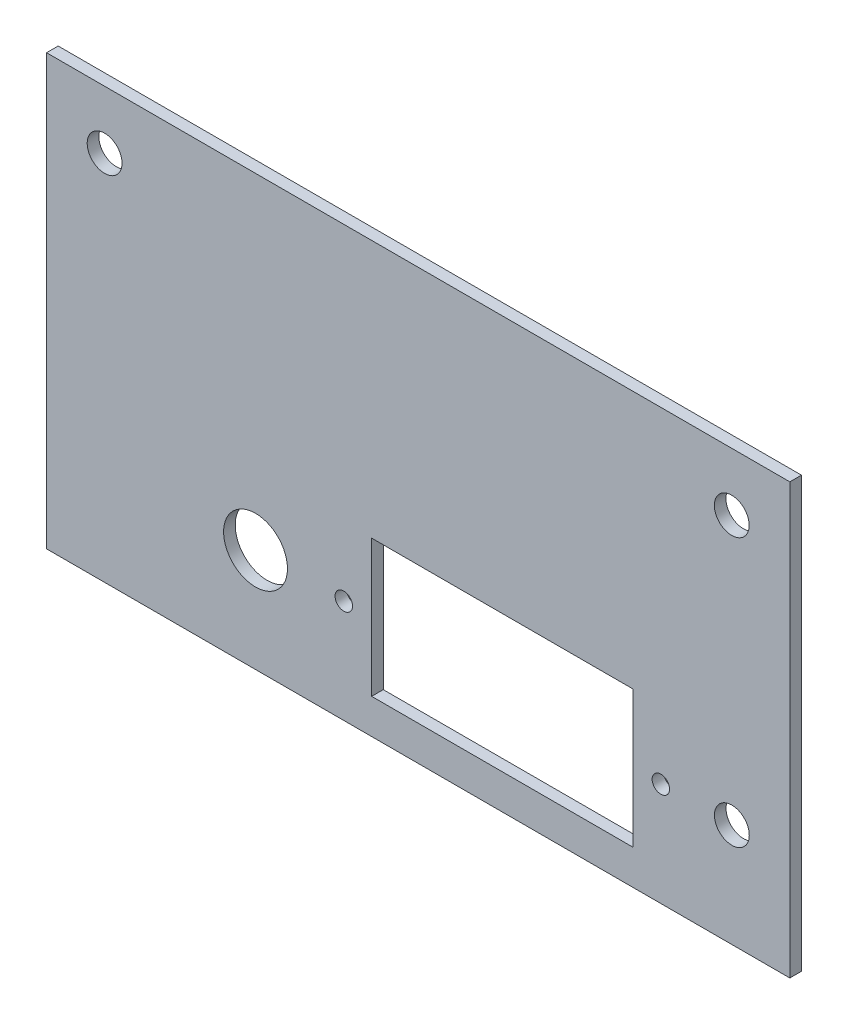
ISO-10303-21;
HEADER;
FILE_DESCRIPTION(('STEP AP214'),'2;1');
FILE_NAME('part.step','',(''),(''),'','','');
FILE_SCHEMA(('AUTOMOTIVE_DESIGN { 1 0 10303 214 1 1 1 1 }'));
ENDSEC;
DATA;
#1=APPLICATION_CONTEXT('core data for automotive mechanical design processes');
#2=APPLICATION_PROTOCOL_DEFINITION('international standard','automotive_design',2000,#1);
#3=PRODUCT_CONTEXT('',#1,'mechanical');
#4=PRODUCT('Part','Part','',(#3));
#5=PRODUCT_RELATED_PRODUCT_CATEGORY('part','',(#4));
#6=PRODUCT_DEFINITION_FORMATION('','',#4);
#7=PRODUCT_DEFINITION_CONTEXT('part definition',#1,'design');
#8=PRODUCT_DEFINITION('design','',#6,#7);
#9=PRODUCT_DEFINITION_SHAPE('','',#8);
#10=(LENGTH_UNIT() NAMED_UNIT(*) SI_UNIT(.MILLI.,.METRE.));
#11=(NAMED_UNIT(*) PLANE_ANGLE_UNIT() SI_UNIT($,.RADIAN.));
#12=(NAMED_UNIT(*) SI_UNIT($,.STERADIAN.) SOLID_ANGLE_UNIT());
#13=UNCERTAINTY_MEASURE_WITH_UNIT(LENGTH_MEASURE(1.E-05),#10,'distance_accuracy_value','');
#14=(GEOMETRIC_REPRESENTATION_CONTEXT(3) GLOBAL_UNCERTAINTY_ASSIGNED_CONTEXT((#13)) GLOBAL_UNIT_ASSIGNED_CONTEXT((#10,
#11,#12)) REPRESENTATION_CONTEXT('',''));
#15=CARTESIAN_POINT('',(0.,0.,0.));
#16=DIRECTION('',(0.,0.,1.));
#17=DIRECTION('',(1.,0.,0.));
#18=AXIS2_PLACEMENT_3D('',#15,#16,#17);
#19=CARTESIAN_POINT('',(0.,0.,1.));
#20=DIRECTION('',(0.,0.,1.));
#21=DIRECTION('',(1.,0.,0.));
#22=AXIS2_PLACEMENT_3D('',#19,#20,#21);
#23=PLANE('',#22);
#24=CARTESIAN_POINT('',(-5.32391187167302,-2.59514563290433,1.));
#25=DIRECTION('',(0.,0.,1.));
#26=DIRECTION('',(1.,0.,0.));
#27=AXIS2_PLACEMENT_3D('',#24,#25,#26);
#28=CIRCLE('',#27,2.7500000005369);
#29=CARTESIAN_POINT('',(-2.57391187113612,-2.59514563290433,1.));
#30=VERTEX_POINT('',#29);
#31=EDGE_CURVE('E265',#30,#30,#28,.T.);
#32=ORIENTED_EDGE('',*,*,#31,.F.);
#33=EDGE_LOOP('',(#32));
#34=FACE_BOUND('',#33,.T.);
#35=CARTESIAN_POINT('',(29.576088128327,-2.59514563290433,1.));
#36=DIRECTION('',(0.,0.,1.));
#37=DIRECTION('',(1.,0.,0.));
#38=AXIS2_PLACEMENT_3D('',#35,#36,#37);
#39=CIRCLE('',#38,0.750000000000002);
#40=CARTESIAN_POINT('',(30.326088128327,-2.59514563290433,1.));
#41=VERTEX_POINT('',#40);
#42=EDGE_CURVE('E277',#41,#41,#39,.T.);
#43=ORIENTED_EDGE('',*,*,#42,.F.);
#44=EDGE_LOOP('',(#43));
#45=FACE_BOUND('',#44,.T.);
#46=DIRECTION('',(1.,0.,0.));
#47=VECTOR('',#46,1.);
#48=CARTESIAN_POINT('',(4.67608812832698,-8.49514563290433,1.));
#49=LINE('',#48,#47);
#50=CARTESIAN_POINT('',(4.67608812832698,-8.49514563290433,1.));
#51=VERTEX_POINT('',#50);
#52=CARTESIAN_POINT('',(27.176088128327,-8.49514563290433,1.));
#53=VERTEX_POINT('',#52);
#54=EDGE_CURVE('E107',#51,#53,#49,.T.);
#55=ORIENTED_EDGE('',*,*,#54,.F.);
#56=DIRECTION('',(0.,-1.,0.));
#57=VECTOR('',#56,1.);
#58=CARTESIAN_POINT('',(4.67608812832698,3.30485436709567,1.));
#59=LINE('',#58,#57);
#60=CARTESIAN_POINT('',(4.67608812832698,3.30485436709567,1.));
#61=VERTEX_POINT('',#60);
#62=EDGE_CURVE('E99',#61,#51,#59,.T.);
#63=ORIENTED_EDGE('',*,*,#62,.F.);
#64=DIRECTION('',(-1.,0.,0.));
#65=VECTOR('',#64,1.);
#66=CARTESIAN_POINT('',(4.67608812832698,3.30485436709567,1.));
#67=LINE('',#66,#65);
#68=CARTESIAN_POINT('',(27.176088128327,3.30485436709567,1.));
#69=VERTEX_POINT('',#68);
#70=EDGE_CURVE('E122',#69,#61,#67,.T.);
#71=ORIENTED_EDGE('',*,*,#70,.F.);
#72=DIRECTION('',(0.,1.,0.));
#73=VECTOR('',#72,1.);
#74=CARTESIAN_POINT('',(27.176088128327,3.30485436709567,1.));
#75=LINE('',#74,#73);
#76=EDGE_CURVE('E120',#53,#69,#75,.T.);
#77=ORIENTED_EDGE('',*,*,#76,.F.);
#78=EDGE_LOOP('',(#55,#63,#71,#77));
#79=FACE_BOUND('',#78,.T.);
#80=CARTESIAN_POINT('',(-18.317093511673,20.5048543670957,1.));
#81=DIRECTION('',(0.,0.,1.));
#82=DIRECTION('',(1.,0.,0.));
#83=AXIS2_PLACEMENT_3D('',#80,#81,#82);
#84=CIRCLE('',#83,1.5);
#85=CARTESIAN_POINT('',(-16.817093511673,20.5048543670957,1.));
#86=VERTEX_POINT('',#85);
#87=EDGE_CURVE('E138',#86,#86,#84,.T.);
#88=ORIENTED_EDGE('',*,*,#87,.F.);
#89=EDGE_LOOP('',(#88));
#90=FACE_BOUND('',#89,.T.);
#91=DIRECTION('',(0.,-1.,0.));
#92=VECTOR('',#91,1.);
#93=CARTESIAN_POINT('',(-23.317093511673,25.5048543670957,1.));
#94=LINE('',#93,#92);
#95=CARTESIAN_POINT('',(-23.317093511673,25.5048543670957,1.));
#96=VERTEX_POINT('',#95);
#97=CARTESIAN_POINT('',(-23.317093511673,-11.4951456329043,1.));
#98=VERTEX_POINT('',#97);
#99=EDGE_CURVE('E144',#96,#98,#94,.T.);
#100=ORIENTED_EDGE('',*,*,#99,.T.);
#101=DIRECTION('',(1.,0.,0.));
#102=VECTOR('',#101,1.);
#103=CARTESIAN_POINT('',(-23.317093511673,-11.4951456329043,1.));
#104=LINE('',#103,#102);
#105=CARTESIAN_POINT('',(40.682906488327,-11.4951456329043,1.));
#106=VERTEX_POINT('',#105);
#107=EDGE_CURVE('E147',#98,#106,#104,.T.);
#108=ORIENTED_EDGE('',*,*,#107,.T.);
#109=DIRECTION('',(0.,1.,0.));
#110=VECTOR('',#109,1.);
#111=CARTESIAN_POINT('',(40.682906488327,25.5048543670957,1.));
#112=LINE('',#111,#110);
#113=CARTESIAN_POINT('',(40.682906488327,25.5048543670957,1.));
#114=VERTEX_POINT('',#113);
#115=EDGE_CURVE('E150',#106,#114,#112,.T.);
#116=ORIENTED_EDGE('',*,*,#115,.T.);
#117=DIRECTION('',(-1.,0.,0.));
#118=VECTOR('',#117,1.);
#119=CARTESIAN_POINT('',(-23.317093511673,25.5048543670957,1.));
#120=LINE('',#119,#118);
#121=EDGE_CURVE('E152',#114,#96,#120,.T.);
#122=ORIENTED_EDGE('',*,*,#121,.T.);
#123=EDGE_LOOP('',(#100,#108,#116,#122));
#124=FACE_BOUND('',#123,.T.);
#125=CARTESIAN_POINT('',(35.682906488327,20.5048543670957,1.));
#126=DIRECTION('',(0.,0.,1.));
#127=DIRECTION('',(1.,0.,0.));
#128=AXIS2_PLACEMENT_3D('',#125,#126,#127);
#129=CIRCLE('',#128,1.5);
#130=CARTESIAN_POINT('',(37.182906488327,20.5048543670957,1.));
#131=VERTEX_POINT('',#130);
#132=EDGE_CURVE('E128',#131,#131,#129,.T.);
#133=ORIENTED_EDGE('',*,*,#132,.F.);
#134=EDGE_LOOP('',(#133));
#135=FACE_BOUND('',#134,.T.);
#136=CARTESIAN_POINT('',(2.27608812832698,-2.59514563290433,1.));
#137=DIRECTION('',(0.,0.,1.));
#138=DIRECTION('',(1.,0.,0.));
#139=AXIS2_PLACEMENT_3D('',#136,#137,#138);
#140=CIRCLE('',#139,0.75);
#141=CARTESIAN_POINT('',(3.02608812832698,-2.59514563290433,1.));
#142=VERTEX_POINT('',#141);
#143=EDGE_CURVE('E271',#142,#142,#140,.T.);
#144=ORIENTED_EDGE('',*,*,#143,.F.);
#145=EDGE_LOOP('',(#144));
#146=FACE_BOUND('',#145,.T.);
#147=CARTESIAN_POINT('',(35.690737833595,-2.59514563290433,1.));
#148=DIRECTION('',(0.,0.,1.));
#149=DIRECTION('',(1.,0.,0.));
#150=AXIS2_PLACEMENT_3D('',#147,#148,#149);
#151=CIRCLE('',#150,1.50000000053691);
#152=CARTESIAN_POINT('',(37.1907378341319,-2.59514563290433,1.));
#153=VERTEX_POINT('',#152);
#154=EDGE_CURVE('E256',#153,#153,#151,.T.);
#155=ORIENTED_EDGE('',*,*,#154,.F.);
#156=EDGE_LOOP('',(#155));
#157=FACE_BOUND('',#156,.T.);
#158=ADVANCED_FACE('F34',(#34,#45,#79,#90,#124,#135,#146,#157),#23,.T.);
#159=CARTESIAN_POINT('',(0.,0.,0.));
#160=DIRECTION('',(0.,0.,1.));
#161=DIRECTION('',(1.,0.,0.));
#162=AXIS2_PLACEMENT_3D('',#159,#160,#161);
#163=PLANE('',#162);
#164=CARTESIAN_POINT('',(-18.317093511673,20.5048543670957,0.));
#165=DIRECTION('',(0.,0.,1.));
#166=DIRECTION('',(1.,0.,0.));
#167=AXIS2_PLACEMENT_3D('',#164,#165,#166);
#168=CIRCLE('',#167,1.5);
#169=CARTESIAN_POINT('',(-16.817093511673,20.5048543670957,0.));
#170=VERTEX_POINT('',#169);
#171=EDGE_CURVE('E115',#170,#170,#168,.T.);
#172=ORIENTED_EDGE('',*,*,#171,.T.);
#173=EDGE_LOOP('',(#172));
#174=FACE_BOUND('',#173,.T.);
#175=DIRECTION('',(0.,-1.,0.));
#176=VECTOR('',#175,1.);
#177=CARTESIAN_POINT('',(-23.317093511673,25.5048543670957,0.));
#178=LINE('',#177,#176);
#179=CARTESIAN_POINT('',(-23.317093511673,25.5048543670957,0.));
#180=VERTEX_POINT('',#179);
#181=CARTESIAN_POINT('',(-23.317093511673,-11.4951456329043,0.));
#182=VERTEX_POINT('',#181);
#183=EDGE_CURVE('E141',#180,#182,#178,.T.);
#184=ORIENTED_EDGE('',*,*,#183,.F.);
#185=DIRECTION('',(-1.,0.,0.));
#186=VECTOR('',#185,1.);
#187=CARTESIAN_POINT('',(-23.317093511673,25.5048543670957,0.));
#188=LINE('',#187,#186);
#189=CARTESIAN_POINT('',(40.682906488327,25.5048543670957,0.));
#190=VERTEX_POINT('',#189);
#191=EDGE_CURVE('E148',#190,#180,#188,.T.);
#192=ORIENTED_EDGE('',*,*,#191,.F.);
#193=DIRECTION('',(0.,1.,0.));
#194=VECTOR('',#193,1.);
#195=CARTESIAN_POINT('',(40.682906488327,25.5048543670957,0.));
#196=LINE('',#195,#194);
#197=CARTESIAN_POINT('',(40.682906488327,-11.4951456329043,0.));
#198=VERTEX_POINT('',#197);
#199=EDGE_CURVE('E159',#198,#190,#196,.T.);
#200=ORIENTED_EDGE('',*,*,#199,.F.);
#201=DIRECTION('',(1.,0.,0.));
#202=VECTOR('',#201,1.);
#203=CARTESIAN_POINT('',(-23.317093511673,-11.4951456329043,0.));
#204=LINE('',#203,#202);
#205=EDGE_CURVE('E157',#182,#198,#204,.T.);
#206=ORIENTED_EDGE('',*,*,#205,.F.);
#207=EDGE_LOOP('',(#184,#192,#200,#206));
#208=FACE_BOUND('',#207,.T.);
#209=DIRECTION('',(0.,-1.,0.));
#210=VECTOR('',#209,1.);
#211=CARTESIAN_POINT('',(4.67608812832698,3.30485436709567,0.));
#212=LINE('',#211,#210);
#213=CARTESIAN_POINT('',(4.67608812832698,3.30485436709567,0.));
#214=VERTEX_POINT('',#213);
#215=CARTESIAN_POINT('',(4.67608812832698,-8.49514563290433,0.));
#216=VERTEX_POINT('',#215);
#217=EDGE_CURVE('E57',#214,#216,#212,.T.);
#218=ORIENTED_EDGE('',*,*,#217,.T.);
#219=DIRECTION('',(1.,0.,0.));
#220=VECTOR('',#219,1.);
#221=CARTESIAN_POINT('',(4.67608812832698,-8.49514563290433,0.));
#222=LINE('',#221,#220);
#223=CARTESIAN_POINT('',(27.176088128327,-8.49514563290433,0.));
#224=VERTEX_POINT('',#223);
#225=EDGE_CURVE('E114',#216,#224,#222,.T.);
#226=ORIENTED_EDGE('',*,*,#225,.T.);
#227=DIRECTION('',(0.,1.,0.));
#228=VECTOR('',#227,1.);
#229=CARTESIAN_POINT('',(27.176088128327,3.30485436709567,0.));
#230=LINE('',#229,#228);
#231=CARTESIAN_POINT('',(27.176088128327,3.30485436709567,0.));
#232=VERTEX_POINT('',#231);
#233=EDGE_CURVE('E130',#224,#232,#230,.T.);
#234=ORIENTED_EDGE('',*,*,#233,.T.);
#235=DIRECTION('',(-1.,0.,0.));
#236=VECTOR('',#235,1.);
#237=CARTESIAN_POINT('',(4.67608812832698,3.30485436709567,0.));
#238=LINE('',#237,#236);
#239=EDGE_CURVE('E108',#232,#214,#238,.T.);
#240=ORIENTED_EDGE('',*,*,#239,.T.);
#241=EDGE_LOOP('',(#218,#226,#234,#240));
#242=FACE_BOUND('',#241,.T.);
#243=CARTESIAN_POINT('',(35.682906488327,20.5048543670957,0.));
#244=DIRECTION('',(0.,0.,1.));
#245=DIRECTION('',(1.,0.,0.));
#246=AXIS2_PLACEMENT_3D('',#243,#244,#245);
#247=CIRCLE('',#246,1.5);
#248=CARTESIAN_POINT('',(37.182906488327,20.5048543670957,0.));
#249=VERTEX_POINT('',#248);
#250=EDGE_CURVE('E280',#249,#249,#247,.T.);
#251=ORIENTED_EDGE('',*,*,#250,.T.);
#252=EDGE_LOOP('',(#251));
#253=FACE_BOUND('',#252,.T.);
#254=CARTESIAN_POINT('',(29.576088128327,-2.59514563290433,0.));
#255=DIRECTION('',(0.,0.,1.));
#256=DIRECTION('',(1.,0.,0.));
#257=AXIS2_PLACEMENT_3D('',#254,#255,#256);
#258=CIRCLE('',#257,0.750000000000002);
#259=CARTESIAN_POINT('',(30.326088128327,-2.59514563290433,0.));
#260=VERTEX_POINT('',#259);
#261=EDGE_CURVE('E274',#260,#260,#258,.T.);
#262=ORIENTED_EDGE('',*,*,#261,.T.);
#263=EDGE_LOOP('',(#262));
#264=FACE_BOUND('',#263,.T.);
#265=CARTESIAN_POINT('',(2.27608812832698,-2.59514563290433,0.));
#266=DIRECTION('',(0.,0.,1.));
#267=DIRECTION('',(1.,0.,0.));
#268=AXIS2_PLACEMENT_3D('',#265,#266,#267);
#269=CIRCLE('',#268,0.75);
#270=CARTESIAN_POINT('',(3.02608812832698,-2.59514563290433,0.));
#271=VERTEX_POINT('',#270);
#272=EDGE_CURVE('E268',#271,#271,#269,.T.);
#273=ORIENTED_EDGE('',*,*,#272,.T.);
#274=EDGE_LOOP('',(#273));
#275=FACE_BOUND('',#274,.T.);
#276=CARTESIAN_POINT('',(-5.32391187167302,-2.59514563290433,0.));
#277=DIRECTION('',(0.,0.,1.));
#278=DIRECTION('',(1.,0.,0.));
#279=AXIS2_PLACEMENT_3D('',#276,#277,#278);
#280=CIRCLE('',#279,2.7500000005369);
#281=CARTESIAN_POINT('',(-2.57391187113612,-2.59514563290433,0.));
#282=VERTEX_POINT('',#281);
#283=EDGE_CURVE('E262',#282,#282,#280,.T.);
#284=ORIENTED_EDGE('',*,*,#283,.T.);
#285=EDGE_LOOP('',(#284));
#286=FACE_BOUND('',#285,.T.);
#287=CARTESIAN_POINT('',(35.690737833595,-2.59514563290433,0.));
#288=DIRECTION('',(0.,0.,1.));
#289=DIRECTION('',(1.,0.,0.));
#290=AXIS2_PLACEMENT_3D('',#287,#288,#289);
#291=CIRCLE('',#290,1.50000000053691);
#292=CARTESIAN_POINT('',(37.1907378341319,-2.59514563290433,0.));
#293=VERTEX_POINT('',#292);
#294=EDGE_CURVE('E259',#293,#293,#291,.T.);
#295=ORIENTED_EDGE('',*,*,#294,.T.);
#296=EDGE_LOOP('',(#295));
#297=FACE_BOUND('',#296,.T.);
#298=ADVANCED_FACE('F177',(#174,#208,#242,#253,#264,#275,#286,#297),#163,.F.);
#299=CARTESIAN_POINT('',(-23.317093511673,25.5048543670957,1.));
#300=DIRECTION('',(1.,0.,0.));
#301=DIRECTION('',(0.,1.,0.));
#302=AXIS2_PLACEMENT_3D('',#299,#300,#301);
#303=PLANE('',#302);
#304=ORIENTED_EDGE('',*,*,#183,.T.);
#305=DIRECTION('',(0.,0.,-1.));
#306=VECTOR('',#305,1.);
#307=CARTESIAN_POINT('',(-23.317093511673,-11.4951456329043,1.));
#308=LINE('',#307,#306);
#309=EDGE_CURVE('E11',#98,#182,#308,.T.);
#310=ORIENTED_EDGE('',*,*,#309,.F.);
#311=ORIENTED_EDGE('',*,*,#99,.F.);
#312=DIRECTION('',(0.,0.,-1.));
#313=VECTOR('',#312,1.);
#314=CARTESIAN_POINT('',(-23.317093511673,25.5048543670957,1.));
#315=LINE('',#314,#313);
#316=EDGE_CURVE('E154',#96,#180,#315,.T.);
#317=ORIENTED_EDGE('',*,*,#316,.T.);
#318=EDGE_LOOP('',(#304,#310,#311,#317));
#319=FACE_BOUND('',#318,.T.);
#320=ADVANCED_FACE('F36',(#319),#303,.F.);
#321=CARTESIAN_POINT('',(-23.317093511673,-11.4951456329043,1.));
#322=DIRECTION('',(0.,1.,0.));
#323=DIRECTION('',(-1.,0.,0.));
#324=AXIS2_PLACEMENT_3D('',#321,#322,#323);
#325=PLANE('',#324);
#326=ORIENTED_EDGE('',*,*,#205,.T.);
#327=DIRECTION('',(0.,0.,-1.));
#328=VECTOR('',#327,1.);
#329=CARTESIAN_POINT('',(40.682906488327,-11.4951456329043,1.));
#330=LINE('',#329,#328);
#331=EDGE_CURVE('E42',#106,#198,#330,.T.);
#332=ORIENTED_EDGE('',*,*,#331,.F.);
#333=ORIENTED_EDGE('',*,*,#107,.F.);
#334=ORIENTED_EDGE('',*,*,#309,.T.);
#335=EDGE_LOOP('',(#326,#332,#333,#334));
#336=FACE_BOUND('',#335,.T.);
#337=ADVANCED_FACE('F188',(#336),#325,.F.);
#338=CARTESIAN_POINT('',(40.682906488327,25.5048543670957,1.));
#339=DIRECTION('',(-1.,0.,0.));
#340=DIRECTION('',(0.,-1.,0.));
#341=AXIS2_PLACEMENT_3D('',#338,#339,#340);
#342=PLANE('',#341);
#343=ORIENTED_EDGE('',*,*,#199,.T.);
#344=DIRECTION('',(0.,0.,-1.));
#345=VECTOR('',#344,1.);
#346=CARTESIAN_POINT('',(40.682906488327,25.5048543670957,1.));
#347=LINE('',#346,#345);
#348=EDGE_CURVE('E164',#114,#190,#347,.T.);
#349=ORIENTED_EDGE('',*,*,#348,.F.);
#350=ORIENTED_EDGE('',*,*,#115,.F.);
#351=ORIENTED_EDGE('',*,*,#331,.T.);
#352=EDGE_LOOP('',(#343,#349,#350,#351));
#353=FACE_BOUND('',#352,.T.);
#354=ADVANCED_FACE('F171',(#353),#342,.F.);
#355=CARTESIAN_POINT('',(-23.317093511673,25.5048543670957,1.));
#356=DIRECTION('',(0.,-1.,0.));
#357=DIRECTION('',(1.,0.,0.));
#358=AXIS2_PLACEMENT_3D('',#355,#356,#357);
#359=PLANE('',#358);
#360=ORIENTED_EDGE('',*,*,#191,.T.);
#361=ORIENTED_EDGE('',*,*,#316,.F.);
#362=ORIENTED_EDGE('',*,*,#121,.F.);
#363=ORIENTED_EDGE('',*,*,#348,.T.);
#364=EDGE_LOOP('',(#360,#361,#362,#363));
#365=FACE_BOUND('',#364,.T.);
#366=ADVANCED_FACE('F181',(#365),#359,.F.);
#367=CARTESIAN_POINT('',(-18.317093511673,20.5048543670957,1.));
#368=DIRECTION('',(0.,0.,-1.));
#369=DIRECTION('',(-1.,0.,0.));
#370=AXIS2_PLACEMENT_3D('',#367,#368,#369);
#371=CYLINDRICAL_SURFACE('',#370,1.5);
#372=ORIENTED_EDGE('',*,*,#87,.T.);
#373=EDGE_LOOP('',(#372));
#374=FACE_BOUND('',#373,.T.);
#375=ORIENTED_EDGE('',*,*,#171,.F.);
#376=EDGE_LOOP('',(#375));
#377=FACE_BOUND('',#376,.T.);
#378=ADVANCED_FACE('F206',(#374,#377),#371,.F.);
#379=CARTESIAN_POINT('',(4.67608812832698,3.30485436709567,1.));
#380=DIRECTION('',(1.,0.,0.));
#381=DIRECTION('',(0.,1.,0.));
#382=AXIS2_PLACEMENT_3D('',#379,#380,#381);
#383=PLANE('',#382);
#384=ORIENTED_EDGE('',*,*,#217,.F.);
#385=DIRECTION('',(0.,0.,-1.));
#386=VECTOR('',#385,1.);
#387=CARTESIAN_POINT('',(4.67608812832698,3.30485436709567,1.));
#388=LINE('',#387,#386);
#389=EDGE_CURVE('E103',#61,#214,#388,.T.);
#390=ORIENTED_EDGE('',*,*,#389,.F.);
#391=ORIENTED_EDGE('',*,*,#62,.T.);
#392=DIRECTION('',(0.,0.,-1.));
#393=VECTOR('',#392,1.);
#394=CARTESIAN_POINT('',(4.67608812832698,-8.49514563290433,1.));
#395=LINE('',#394,#393);
#396=EDGE_CURVE('E102',#51,#216,#395,.T.);
#397=ORIENTED_EDGE('',*,*,#396,.T.);
#398=EDGE_LOOP('',(#384,#390,#391,#397));
#399=FACE_BOUND('',#398,.T.);
#400=ADVANCED_FACE('F101',(#399),#383,.T.);
#401=CARTESIAN_POINT('',(4.67608812832698,-8.49514563290433,1.));
#402=DIRECTION('',(0.,1.,0.));
#403=DIRECTION('',(0.,0.,1.));
#404=AXIS2_PLACEMENT_3D('',#401,#402,#403);
#405=PLANE('',#404);
#406=ORIENTED_EDGE('',*,*,#225,.F.);
#407=ORIENTED_EDGE('',*,*,#396,.F.);
#408=ORIENTED_EDGE('',*,*,#54,.T.);
#409=DIRECTION('',(0.,0.,-1.));
#410=VECTOR('',#409,1.);
#411=CARTESIAN_POINT('',(27.176088128327,-8.49514563290433,1.));
#412=LINE('',#411,#410);
#413=EDGE_CURVE('E116',#53,#224,#412,.T.);
#414=ORIENTED_EDGE('',*,*,#413,.T.);
#415=EDGE_LOOP('',(#406,#407,#408,#414));
#416=FACE_BOUND('',#415,.T.);
#417=ADVANCED_FACE('F111',(#416),#405,.T.);
#418=CARTESIAN_POINT('',(27.176088128327,3.30485436709567,1.));
#419=DIRECTION('',(-1.,0.,0.));
#420=DIRECTION('',(0.,0.,1.));
#421=AXIS2_PLACEMENT_3D('',#418,#419,#420);
#422=PLANE('',#421);
#423=ORIENTED_EDGE('',*,*,#233,.F.);
#424=ORIENTED_EDGE('',*,*,#413,.F.);
#425=ORIENTED_EDGE('',*,*,#76,.T.);
#426=DIRECTION('',(0.,0.,-1.));
#427=VECTOR('',#426,1.);
#428=CARTESIAN_POINT('',(27.176088128327,3.30485436709567,1.));
#429=LINE('',#428,#427);
#430=EDGE_CURVE('E49',#69,#232,#429,.T.);
#431=ORIENTED_EDGE('',*,*,#430,.T.);
#432=EDGE_LOOP('',(#423,#424,#425,#431));
#433=FACE_BOUND('',#432,.T.);
#434=ADVANCED_FACE('F223',(#433),#422,.T.);
#435=CARTESIAN_POINT('',(4.67608812832698,3.30485436709567,1.));
#436=DIRECTION('',(0.,-1.,0.));
#437=DIRECTION('',(0.,0.,-1.));
#438=AXIS2_PLACEMENT_3D('',#435,#436,#437);
#439=PLANE('',#438);
#440=ORIENTED_EDGE('',*,*,#239,.F.);
#441=ORIENTED_EDGE('',*,*,#430,.F.);
#442=ORIENTED_EDGE('',*,*,#70,.T.);
#443=ORIENTED_EDGE('',*,*,#389,.T.);
#444=EDGE_LOOP('',(#440,#441,#442,#443));
#445=FACE_BOUND('',#444,.T.);
#446=ADVANCED_FACE('F228',(#445),#439,.T.);
#447=CARTESIAN_POINT('',(35.682906488327,20.5048543670957,1.));
#448=DIRECTION('',(0.,0.,-1.));
#449=DIRECTION('',(-1.,0.,0.));
#450=AXIS2_PLACEMENT_3D('',#447,#448,#449);
#451=CYLINDRICAL_SURFACE('',#450,1.5);
#452=ORIENTED_EDGE('',*,*,#132,.T.);
#453=EDGE_LOOP('',(#452));
#454=FACE_BOUND('',#453,.T.);
#455=ORIENTED_EDGE('',*,*,#250,.F.);
#456=EDGE_LOOP('',(#455));
#457=FACE_BOUND('',#456,.T.);
#458=ADVANCED_FACE('F232',(#454,#457),#451,.F.);
#459=CARTESIAN_POINT('',(29.576088128327,-2.59514563290433,1.));
#460=DIRECTION('',(0.,0.,-1.));
#461=DIRECTION('',(-1.,0.,0.));
#462=AXIS2_PLACEMENT_3D('',#459,#460,#461);
#463=CYLINDRICAL_SURFACE('',#462,0.750000000000002);
#464=ORIENTED_EDGE('',*,*,#42,.T.);
#465=EDGE_LOOP('',(#464));
#466=FACE_BOUND('',#465,.T.);
#467=ORIENTED_EDGE('',*,*,#261,.F.);
#468=EDGE_LOOP('',(#467));
#469=FACE_BOUND('',#468,.T.);
#470=ADVANCED_FACE('F235',(#466,#469),#463,.F.);
#471=CARTESIAN_POINT('',(2.27608812832698,-2.59514563290433,1.));
#472=DIRECTION('',(0.,0.,-1.));
#473=DIRECTION('',(-1.,0.,0.));
#474=AXIS2_PLACEMENT_3D('',#471,#472,#473);
#475=CYLINDRICAL_SURFACE('',#474,0.75);
#476=ORIENTED_EDGE('',*,*,#143,.T.);
#477=EDGE_LOOP('',(#476));
#478=FACE_BOUND('',#477,.T.);
#479=ORIENTED_EDGE('',*,*,#272,.F.);
#480=EDGE_LOOP('',(#479));
#481=FACE_BOUND('',#480,.T.);
#482=ADVANCED_FACE('F239',(#478,#481),#475,.F.);
#483=CARTESIAN_POINT('',(-5.32391187167302,-2.59514563290433,1.));
#484=DIRECTION('',(0.,0.,-1.));
#485=DIRECTION('',(-1.,0.,0.));
#486=AXIS2_PLACEMENT_3D('',#483,#484,#485);
#487=CYLINDRICAL_SURFACE('',#486,2.7500000005369);
#488=ORIENTED_EDGE('',*,*,#31,.T.);
#489=EDGE_LOOP('',(#488));
#490=FACE_BOUND('',#489,.T.);
#491=ORIENTED_EDGE('',*,*,#283,.F.);
#492=EDGE_LOOP('',(#491));
#493=FACE_BOUND('',#492,.T.);
#494=ADVANCED_FACE('F243',(#490,#493),#487,.F.);
#495=CARTESIAN_POINT('',(35.690737833595,-2.59514563290433,1.));
#496=DIRECTION('',(0.,0.,-1.));
#497=DIRECTION('',(-1.,0.,0.));
#498=AXIS2_PLACEMENT_3D('',#495,#496,#497);
#499=CYLINDRICAL_SURFACE('',#498,1.50000000053691);
#500=ORIENTED_EDGE('',*,*,#154,.T.);
#501=EDGE_LOOP('',(#500));
#502=FACE_BOUND('',#501,.T.);
#503=ORIENTED_EDGE('',*,*,#294,.F.);
#504=EDGE_LOOP('',(#503));
#505=FACE_BOUND('',#504,.T.);
#506=ADVANCED_FACE('F247',(#502,#505),#499,.F.);
#507=CLOSED_SHELL('',(#158,#298,#320,#337,#354,#366,#378,#400,#417,#434,#446,#458,#470,#482,
#494,#506));
#508=MANIFOLD_SOLID_BREP('B2',#507);
#509=ADVANCED_BREP_SHAPE_REPRESENTATION('',(#18,#508),#14);
#510=SHAPE_DEFINITION_REPRESENTATION(#9,#509);
ENDSEC;
END-ISO-10303-21;
